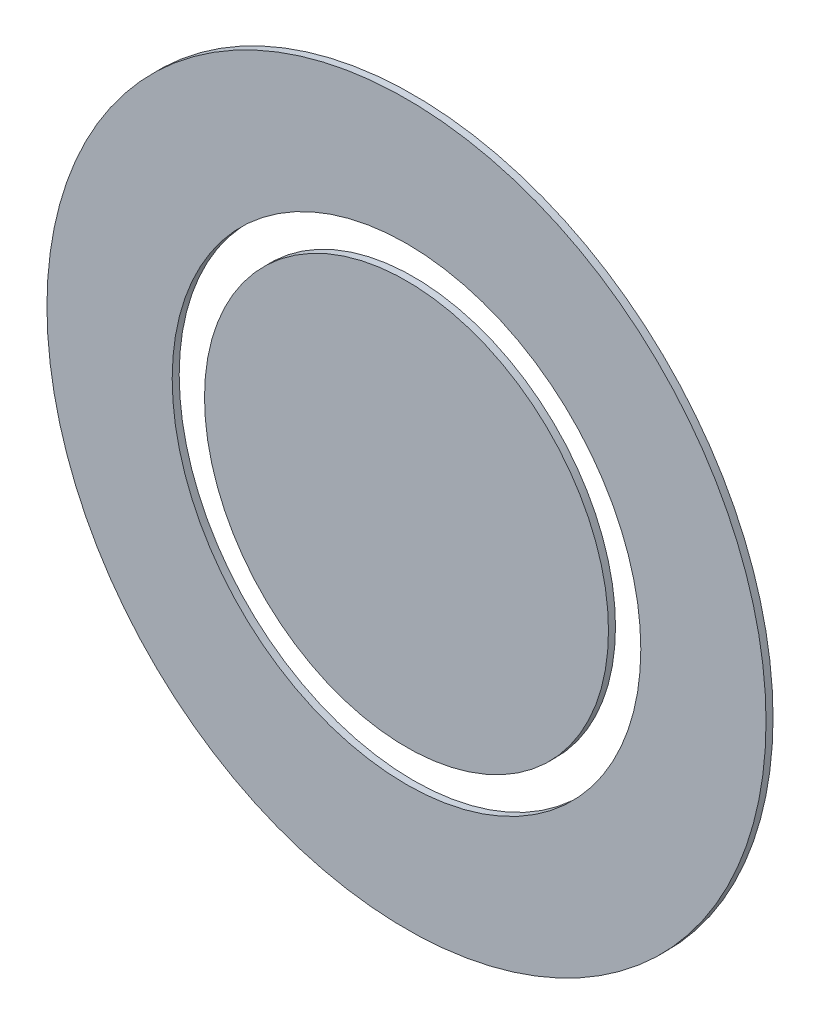
ISO-10303-21;
HEADER;
FILE_DESCRIPTION(('STEP AP214'),'2;1');
FILE_NAME('part.step','',(''),(''),'','','');
FILE_SCHEMA(('AUTOMOTIVE_DESIGN { 1 0 10303 214 1 1 1 1 }'));
ENDSEC;
DATA;
#1=APPLICATION_CONTEXT('core data for automotive mechanical design processes');
#2=APPLICATION_PROTOCOL_DEFINITION('international standard','automotive_design',2000,#1);
#3=PRODUCT_CONTEXT('',#1,'mechanical');
#4=PRODUCT('Part','Part','',(#3));
#5=PRODUCT_RELATED_PRODUCT_CATEGORY('part','',(#4));
#6=PRODUCT_DEFINITION_FORMATION('','',#4);
#7=PRODUCT_DEFINITION_CONTEXT('part definition',#1,'design');
#8=PRODUCT_DEFINITION('design','',#6,#7);
#9=PRODUCT_DEFINITION_SHAPE('','',#8);
#10=(LENGTH_UNIT() NAMED_UNIT(*) SI_UNIT(.MILLI.,.METRE.));
#11=(NAMED_UNIT(*) PLANE_ANGLE_UNIT() SI_UNIT($,.RADIAN.));
#12=(NAMED_UNIT(*) SI_UNIT($,.STERADIAN.) SOLID_ANGLE_UNIT());
#13=UNCERTAINTY_MEASURE_WITH_UNIT(LENGTH_MEASURE(1.E-05),#10,'distance_accuracy_value','');
#14=(GEOMETRIC_REPRESENTATION_CONTEXT(3) GLOBAL_UNCERTAINTY_ASSIGNED_CONTEXT((#13)) GLOBAL_UNIT_ASSIGNED_CONTEXT((#10,
#11,#12)) REPRESENTATION_CONTEXT('',''));
#15=CARTESIAN_POINT('',(0.,0.,0.));
#16=DIRECTION('',(0.,0.,1.));
#17=DIRECTION('',(1.,0.,0.));
#18=AXIS2_PLACEMENT_3D('',#15,#16,#17);
#19=CARTESIAN_POINT('',(0.,0.,2.6));
#20=DIRECTION('',(0.,0.,-1.));
#21=DIRECTION('',(-1.,0.,0.));
#22=AXIS2_PLACEMENT_3D('',#19,#20,#21);
#23=CYLINDRICAL_SURFACE('',#22,87.);
#24=CARTESIAN_POINT('',(0.,0.,2.6));
#25=DIRECTION('',(0.,0.,1.));
#26=DIRECTION('',(1.,0.,0.));
#27=AXIS2_PLACEMENT_3D('',#24,#25,#26);
#28=CIRCLE('',#27,87.);
#29=CARTESIAN_POINT('',(87.,0.,2.6));
#30=VERTEX_POINT('',#29);
#31=EDGE_CURVE('E47',#30,#30,#28,.T.);
#32=ORIENTED_EDGE('',*,*,#31,.T.);
#33=EDGE_LOOP('',(#32));
#34=FACE_BOUND('',#33,.T.);
#35=CARTESIAN_POINT('',(0.,0.,0.));
#36=DIRECTION('',(0.,0.,1.));
#37=DIRECTION('',(1.,0.,0.));
#38=AXIS2_PLACEMENT_3D('',#35,#36,#37);
#39=CIRCLE('',#38,87.);
#40=CARTESIAN_POINT('',(87.,0.,0.));
#41=VERTEX_POINT('',#40);
#42=EDGE_CURVE('E53',#41,#41,#39,.T.);
#43=ORIENTED_EDGE('',*,*,#42,.F.);
#44=EDGE_LOOP('',(#43));
#45=FACE_BOUND('',#44,.T.);
#46=ADVANCED_FACE('F40',(#34,#45),#23,.F.);
#47=CARTESIAN_POINT('',(0.,0.,2.6));
#48=DIRECTION('',(0.,0.,-1.));
#49=DIRECTION('',(-1.,0.,0.));
#50=AXIS2_PLACEMENT_3D('',#47,#48,#49);
#51=CYLINDRICAL_SURFACE('',#50,133.5);
#52=CARTESIAN_POINT('',(0.,0.,2.6));
#53=DIRECTION('',(0.,0.,1.));
#54=DIRECTION('',(1.,0.,0.));
#55=AXIS2_PLACEMENT_3D('',#52,#53,#54);
#56=CIRCLE('',#55,133.5);
#57=CARTESIAN_POINT('',(133.5,0.,2.6));
#58=VERTEX_POINT('',#57);
#59=EDGE_CURVE('E11',#58,#58,#56,.T.);
#60=ORIENTED_EDGE('',*,*,#59,.F.);
#61=EDGE_LOOP('',(#60));
#62=FACE_BOUND('',#61,.T.);
#63=CARTESIAN_POINT('',(0.,0.,0.));
#64=DIRECTION('',(0.,0.,1.));
#65=DIRECTION('',(1.,0.,0.));
#66=AXIS2_PLACEMENT_3D('',#63,#64,#65);
#67=CIRCLE('',#66,133.5);
#68=CARTESIAN_POINT('',(133.5,0.,0.));
#69=VERTEX_POINT('',#68);
#70=EDGE_CURVE('E43',#69,#69,#67,.T.);
#71=ORIENTED_EDGE('',*,*,#70,.T.);
#72=EDGE_LOOP('',(#71));
#73=FACE_BOUND('',#72,.T.);
#74=ADVANCED_FACE('F60',(#62,#73),#51,.T.);
#75=CARTESIAN_POINT('',(0.,0.,2.6));
#76=DIRECTION('',(0.,0.,1.));
#77=DIRECTION('',(1.,0.,0.));
#78=AXIS2_PLACEMENT_3D('',#75,#76,#77);
#79=PLANE('',#78);
#80=ORIENTED_EDGE('',*,*,#31,.F.);
#81=EDGE_LOOP('',(#80));
#82=FACE_BOUND('',#81,.T.);
#83=ORIENTED_EDGE('',*,*,#59,.T.);
#84=EDGE_LOOP('',(#83));
#85=FACE_BOUND('',#84,.T.);
#86=ADVANCED_FACE('F64',(#82,#85),#79,.T.);
#87=CARTESIAN_POINT('',(0.,0.,0.));
#88=DIRECTION('',(0.,0.,1.));
#89=DIRECTION('',(1.,0.,0.));
#90=AXIS2_PLACEMENT_3D('',#87,#88,#89);
#91=PLANE('',#90);
#92=ORIENTED_EDGE('',*,*,#42,.T.);
#93=EDGE_LOOP('',(#92));
#94=FACE_BOUND('',#93,.T.);
#95=ORIENTED_EDGE('',*,*,#70,.F.);
#96=EDGE_LOOP('',(#95));
#97=FACE_BOUND('',#96,.T.);
#98=ADVANCED_FACE('F62',(#94,#97),#91,.F.);
#99=CLOSED_SHELL('',(#46,#74,#86,#98));
#100=MANIFOLD_SOLID_BREP('B2',#99);
#101=CARTESIAN_POINT('',(0.,0.,2.6));
#102=DIRECTION('',(0.,0.,-1.));
#103=DIRECTION('',(-1.,0.,0.));
#104=AXIS2_PLACEMENT_3D('',#101,#102,#103);
#105=CYLINDRICAL_SURFACE('',#104,75.);
#106=CARTESIAN_POINT('',(0.,0.,2.6));
#107=DIRECTION('',(0.,0.,1.));
#108=DIRECTION('',(1.,0.,0.));
#109=AXIS2_PLACEMENT_3D('',#106,#107,#108);
#110=CIRCLE('',#109,75.);
#111=CARTESIAN_POINT('',(75.,0.,2.6));
#112=VERTEX_POINT('',#111);
#113=EDGE_CURVE('E39',#112,#112,#110,.T.);
#114=ORIENTED_EDGE('',*,*,#113,.F.);
#115=EDGE_LOOP('',(#114));
#116=FACE_BOUND('',#115,.T.);
#117=CARTESIAN_POINT('',(0.,0.,0.));
#118=DIRECTION('',(0.,0.,1.));
#119=DIRECTION('',(1.,0.,0.));
#120=AXIS2_PLACEMENT_3D('',#117,#118,#119);
#121=CIRCLE('',#120,75.);
#122=CARTESIAN_POINT('',(75.,0.,0.));
#123=VERTEX_POINT('',#122);
#124=EDGE_CURVE('E104',#123,#123,#121,.T.);
#125=ORIENTED_EDGE('',*,*,#124,.T.);
#126=EDGE_LOOP('',(#125));
#127=FACE_BOUND('',#126,.T.);
#128=ADVANCED_FACE('F101',(#116,#127),#105,.T.);
#129=CARTESIAN_POINT('',(0.,0.,2.6));
#130=DIRECTION('',(0.,0.,1.));
#131=DIRECTION('',(1.,0.,0.));
#132=AXIS2_PLACEMENT_3D('',#129,#130,#131);
#133=PLANE('',#132);
#134=ORIENTED_EDGE('',*,*,#113,.T.);
#135=EDGE_LOOP('',(#134));
#136=FACE_BOUND('',#135,.T.);
#137=ADVANCED_FACE('F116',(#136),#133,.T.);
#138=CARTESIAN_POINT('',(0.,0.,0.));
#139=DIRECTION('',(0.,0.,1.));
#140=DIRECTION('',(1.,0.,0.));
#141=AXIS2_PLACEMENT_3D('',#138,#139,#140);
#142=PLANE('',#141);
#143=ORIENTED_EDGE('',*,*,#124,.F.);
#144=EDGE_LOOP('',(#143));
#145=FACE_BOUND('',#144,.T.);
#146=ADVANCED_FACE('F114',(#145),#142,.F.);
#147=CLOSED_SHELL('',(#128,#137,#146));
#148=MANIFOLD_SOLID_BREP('B6',#147);
#149=ADVANCED_BREP_SHAPE_REPRESENTATION('',(#18,#100,#148),#14);
#150=SHAPE_DEFINITION_REPRESENTATION(#9,#149);
ENDSEC;
END-ISO-10303-21;
